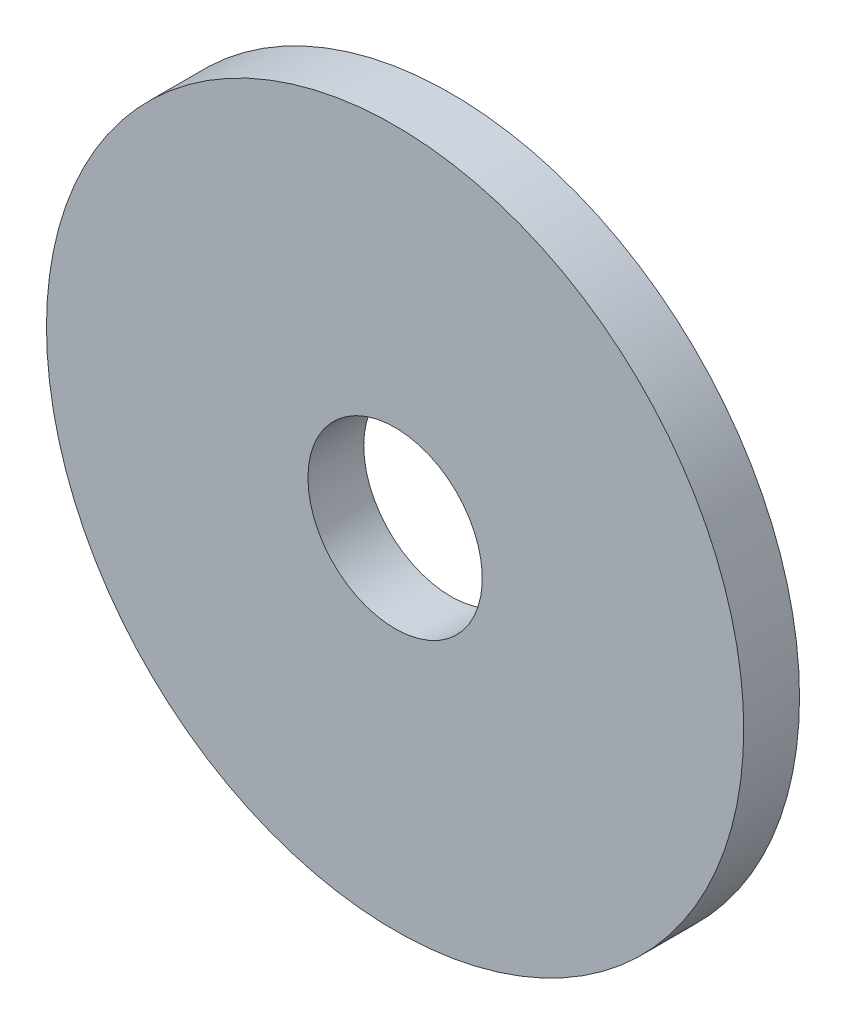
ISO-10303-21;
HEADER;
FILE_DESCRIPTION(('STEP AP214'),'2;1');
FILE_NAME('part.step','',(''),(''),'','','');
FILE_SCHEMA(('AUTOMOTIVE_DESIGN { 1 0 10303 214 1 1 1 1 }'));
ENDSEC;
DATA;
#1=APPLICATION_CONTEXT('core data for automotive mechanical design processes');
#2=APPLICATION_PROTOCOL_DEFINITION('international standard','automotive_design',2000,#1);
#3=PRODUCT_CONTEXT('',#1,'mechanical');
#4=PRODUCT('Part','Part','',(#3));
#5=PRODUCT_RELATED_PRODUCT_CATEGORY('part','',(#4));
#6=PRODUCT_DEFINITION_FORMATION('','',#4);
#7=PRODUCT_DEFINITION_CONTEXT('part definition',#1,'design');
#8=PRODUCT_DEFINITION('design','',#6,#7);
#9=PRODUCT_DEFINITION_SHAPE('','',#8);
#10=(LENGTH_UNIT() NAMED_UNIT(*) SI_UNIT(.MILLI.,.METRE.));
#11=(NAMED_UNIT(*) PLANE_ANGLE_UNIT() SI_UNIT($,.RADIAN.));
#12=(NAMED_UNIT(*) SI_UNIT($,.STERADIAN.) SOLID_ANGLE_UNIT());
#13=UNCERTAINTY_MEASURE_WITH_UNIT(LENGTH_MEASURE(1.E-05),#10,'distance_accuracy_value','');
#14=(GEOMETRIC_REPRESENTATION_CONTEXT(3) GLOBAL_UNCERTAINTY_ASSIGNED_CONTEXT((#13)) GLOBAL_UNIT_ASSIGNED_CONTEXT((#10,
#11,#12)) REPRESENTATION_CONTEXT('',''));
#15=CARTESIAN_POINT('',(0.,0.,0.));
#16=DIRECTION('',(0.,0.,1.));
#17=DIRECTION('',(1.,0.,0.));
#18=AXIS2_PLACEMENT_3D('',#15,#16,#17);
#19=CARTESIAN_POINT('',(0.,0.,2.));
#20=DIRECTION('',(0.,0.,-1.));
#21=DIRECTION('',(-1.,0.,0.));
#22=AXIS2_PLACEMENT_3D('',#19,#20,#21);
#23=CYLINDRICAL_SURFACE('',#22,12.5);
#24=CARTESIAN_POINT('',(0.,0.,2.));
#25=DIRECTION('',(0.,0.,1.));
#26=DIRECTION('',(1.,0.,0.));
#27=AXIS2_PLACEMENT_3D('',#24,#25,#26);
#28=CIRCLE('',#27,12.5);
#29=CARTESIAN_POINT('',(12.5,0.,2.));
#30=VERTEX_POINT('',#29);
#31=EDGE_CURVE('E10',#30,#30,#28,.T.);
#32=ORIENTED_EDGE('',*,*,#31,.F.);
#33=EDGE_LOOP('',(#32));
#34=FACE_BOUND('',#33,.T.);
#35=CARTESIAN_POINT('',(0.,0.,0.));
#36=DIRECTION('',(0.,0.,1.));
#37=DIRECTION('',(1.,0.,0.));
#38=AXIS2_PLACEMENT_3D('',#35,#36,#37);
#39=CIRCLE('',#38,12.5);
#40=CARTESIAN_POINT('',(12.5,0.,0.));
#41=VERTEX_POINT('',#40);
#42=EDGE_CURVE('E35',#41,#41,#39,.T.);
#43=ORIENTED_EDGE('',*,*,#42,.T.);
#44=EDGE_LOOP('',(#43));
#45=FACE_BOUND('',#44,.T.);
#46=ADVANCED_FACE('F32',(#34,#45),#23,.T.);
#47=CARTESIAN_POINT('',(0.,0.,2.));
#48=DIRECTION('',(0.,0.,1.));
#49=DIRECTION('',(1.,0.,0.));
#50=AXIS2_PLACEMENT_3D('',#47,#48,#49);
#51=PLANE('',#50);
#52=CARTESIAN_POINT('',(0.,0.,2.));
#53=DIRECTION('',(0.,0.,-1.));
#54=DIRECTION('',(-1.,0.,0.));
#55=AXIS2_PLACEMENT_3D('',#52,#53,#54);
#56=CIRCLE('',#55,3.125);
#57=CARTESIAN_POINT('',(-3.125,0.,2.));
#58=VERTEX_POINT('',#57);
#59=EDGE_CURVE('E42',#58,#58,#56,.T.);
#60=ORIENTED_EDGE('',*,*,#59,.T.);
#61=EDGE_LOOP('',(#60));
#62=FACE_BOUND('',#61,.T.);
#63=ORIENTED_EDGE('',*,*,#31,.T.);
#64=EDGE_LOOP('',(#63));
#65=FACE_BOUND('',#64,.T.);
#66=ADVANCED_FACE('F50',(#62,#65),#51,.T.);
#67=CARTESIAN_POINT('',(0.,0.,0.));
#68=DIRECTION('',(0.,0.,1.));
#69=DIRECTION('',(1.,0.,0.));
#70=AXIS2_PLACEMENT_3D('',#67,#68,#69);
#71=PLANE('',#70);
#72=CARTESIAN_POINT('',(0.,0.,0.));
#73=DIRECTION('',(0.,0.,-1.));
#74=DIRECTION('',(-1.,0.,0.));
#75=AXIS2_PLACEMENT_3D('',#72,#73,#74);
#76=CIRCLE('',#75,3.125);
#77=CARTESIAN_POINT('',(-3.125,0.,0.));
#78=VERTEX_POINT('',#77);
#79=EDGE_CURVE('E44',#78,#78,#76,.T.);
#80=ORIENTED_EDGE('',*,*,#79,.F.);
#81=EDGE_LOOP('',(#80));
#82=FACE_BOUND('',#81,.T.);
#83=ORIENTED_EDGE('',*,*,#42,.F.);
#84=EDGE_LOOP('',(#83));
#85=FACE_BOUND('',#84,.T.);
#86=ADVANCED_FACE('F55',(#82,#85),#71,.F.);
#87=CARTESIAN_POINT('',(0.,0.,2.));
#88=DIRECTION('',(0.,0.,-1.));
#89=DIRECTION('',(-1.,0.,0.));
#90=AXIS2_PLACEMENT_3D('',#87,#88,#89);
#91=CYLINDRICAL_SURFACE('',#90,3.125);
#92=ORIENTED_EDGE('',*,*,#59,.F.);
#93=EDGE_LOOP('',(#92));
#94=FACE_BOUND('',#93,.T.);
#95=ORIENTED_EDGE('',*,*,#79,.T.);
#96=EDGE_LOOP('',(#95));
#97=FACE_BOUND('',#96,.T.);
#98=ADVANCED_FACE('F52',(#94,#97),#91,.F.);
#99=CLOSED_SHELL('',(#46,#66,#86,#98));
#100=MANIFOLD_SOLID_BREP('B2',#99);
#101=ADVANCED_BREP_SHAPE_REPRESENTATION('',(#18,#100),#14);
#102=SHAPE_DEFINITION_REPRESENTATION(#9,#101);
ENDSEC;
END-ISO-10303-21;
